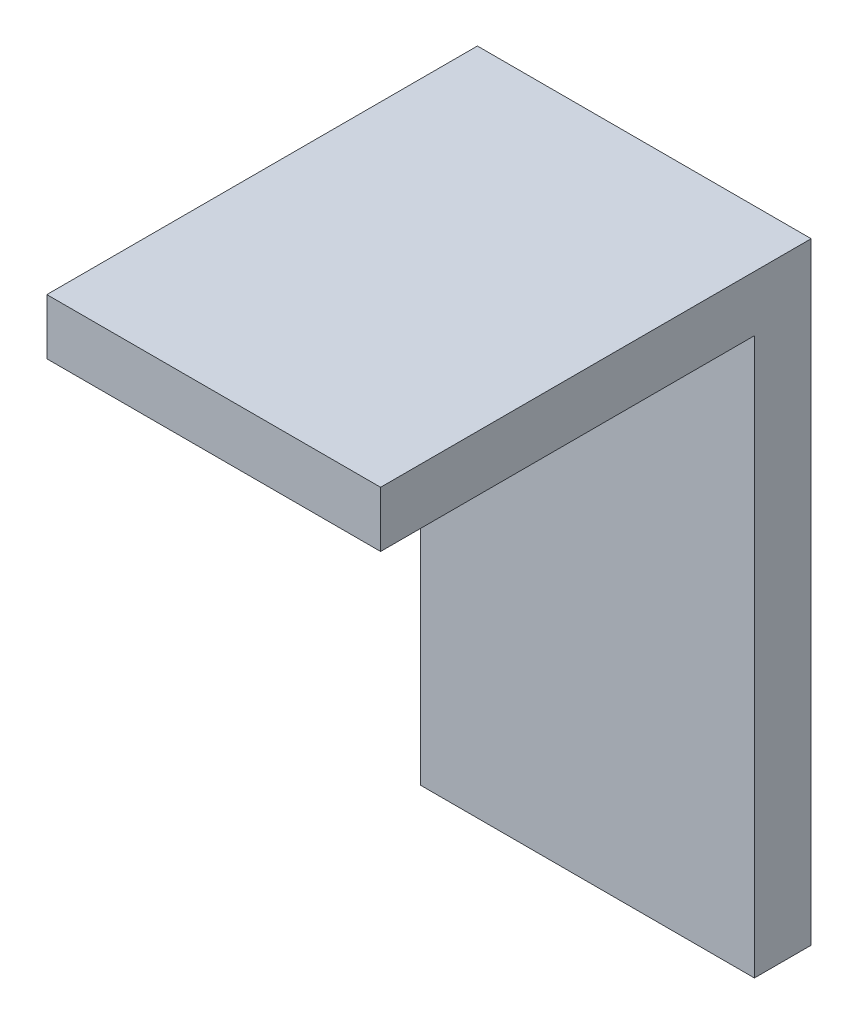
ISO-10303-21;
HEADER;
FILE_DESCRIPTION(('STEP AP214'),'2;1');
FILE_NAME('part.step','',(''),(''),'','','');
FILE_SCHEMA(('AUTOMOTIVE_DESIGN { 1 0 10303 214 1 1 1 1 }'));
ENDSEC;
DATA;
#1=APPLICATION_CONTEXT('core data for automotive mechanical design processes');
#2=APPLICATION_PROTOCOL_DEFINITION('international standard','automotive_design',2000,#1);
#3=PRODUCT_CONTEXT('',#1,'mechanical');
#4=PRODUCT('Part','Part','',(#3));
#5=PRODUCT_RELATED_PRODUCT_CATEGORY('part','',(#4));
#6=PRODUCT_DEFINITION_FORMATION('','',#4);
#7=PRODUCT_DEFINITION_CONTEXT('part definition',#1,'design');
#8=PRODUCT_DEFINITION('design','',#6,#7);
#9=PRODUCT_DEFINITION_SHAPE('','',#8);
#10=(LENGTH_UNIT() NAMED_UNIT(*) SI_UNIT(.MILLI.,.METRE.));
#11=(NAMED_UNIT(*) PLANE_ANGLE_UNIT() SI_UNIT($,.RADIAN.));
#12=(NAMED_UNIT(*) SI_UNIT($,.STERADIAN.) SOLID_ANGLE_UNIT());
#13=UNCERTAINTY_MEASURE_WITH_UNIT(LENGTH_MEASURE(1.E-05),#10,'distance_accuracy_value','');
#14=(GEOMETRIC_REPRESENTATION_CONTEXT(3) GLOBAL_UNCERTAINTY_ASSIGNED_CONTEXT((#13)) GLOBAL_UNIT_ASSIGNED_CONTEXT((#10,
#11,#12)) REPRESENTATION_CONTEXT('',''));
#15=CARTESIAN_POINT('',(0.,0.,0.));
#16=DIRECTION('',(0.,0.,1.));
#17=DIRECTION('',(1.,0.,0.));
#18=AXIS2_PLACEMENT_3D('',#15,#16,#17);
#19=CARTESIAN_POINT('',(1.6,4.55,0.));
#20=DIRECTION('',(-1.,0.,0.));
#21=DIRECTION('',(0.,0.,1.));
#22=AXIS2_PLACEMENT_3D('',#19,#20,#21);
#23=PLANE('',#22);
#24=DIRECTION('',(0.,1.,0.));
#25=VECTOR('',#24,1.);
#26=CARTESIAN_POINT('',(1.6,4.,0.));
#27=LINE('',#26,#25);
#28=CARTESIAN_POINT('',(1.6,4.,0.));
#29=VERTEX_POINT('',#28);
#30=CARTESIAN_POINT('',(1.6,4.55,0.));
#31=VERTEX_POINT('',#30);
#32=EDGE_CURVE('E11',#29,#31,#27,.T.);
#33=ORIENTED_EDGE('',*,*,#32,.F.);
#34=DIRECTION('',(0.,0.,-1.));
#35=VECTOR('',#34,1.);
#36=CARTESIAN_POINT('',(1.6,4.,0.051));
#37=LINE('',#36,#35);
#38=CARTESIAN_POINT('',(1.6,4.,0.051));
#39=VERTEX_POINT('',#38);
#40=EDGE_CURVE('E24',#39,#29,#37,.T.);
#41=ORIENTED_EDGE('',*,*,#40,.F.);
#42=DIRECTION('',(0.,-1.,0.));
#43=VECTOR('',#42,1.);
#44=CARTESIAN_POINT('',(1.6,4.5,0.051));
#45=LINE('',#44,#43);
#46=CARTESIAN_POINT('',(1.6,4.5,0.051));
#47=VERTEX_POINT('',#46);
#48=EDGE_CURVE('E87',#47,#39,#45,.T.);
#49=ORIENTED_EDGE('',*,*,#48,.F.);
#50=DIRECTION('',(0.,0.,-1.));
#51=VECTOR('',#50,1.);
#52=CARTESIAN_POINT('',(1.6,4.5,0.387));
#53=LINE('',#52,#51);
#54=CARTESIAN_POINT('',(1.6,4.5,0.387));
#55=VERTEX_POINT('',#54);
#56=EDGE_CURVE('E114',#55,#47,#53,.T.);
#57=ORIENTED_EDGE('',*,*,#56,.F.);
#58=DIRECTION('',(0.,-1.,0.));
#59=VECTOR('',#58,1.);
#60=CARTESIAN_POINT('',(1.6,4.55,0.387));
#61=LINE('',#60,#59);
#62=CARTESIAN_POINT('',(1.6,4.55,0.387));
#63=VERTEX_POINT('',#62);
#64=EDGE_CURVE('E111',#63,#55,#61,.T.);
#65=ORIENTED_EDGE('',*,*,#64,.F.);
#66=DIRECTION('',(0.,0.,1.));
#67=VECTOR('',#66,1.);
#68=CARTESIAN_POINT('',(1.6,4.55,0.));
#69=LINE('',#68,#67);
#70=EDGE_CURVE('E108',#31,#63,#69,.T.);
#71=ORIENTED_EDGE('',*,*,#70,.F.);
#72=EDGE_LOOP('',(#33,#41,#49,#57,#65,#71));
#73=FACE_BOUND('',#72,.T.);
#74=ADVANCED_FACE('F17',(#73),#23,.T.);
#75=CARTESIAN_POINT('',(1.9,4.,0.));
#76=DIRECTION('',(1.,0.,0.));
#77=DIRECTION('',(0.,0.,1.));
#78=AXIS2_PLACEMENT_3D('',#75,#76,#77);
#79=PLANE('',#78);
#80=DIRECTION('',(0.,-1.,0.));
#81=VECTOR('',#80,1.);
#82=CARTESIAN_POINT('',(1.9,4.55,0.));
#83=LINE('',#82,#81);
#84=CARTESIAN_POINT('',(1.9,4.55,0.));
#85=VERTEX_POINT('',#84);
#86=CARTESIAN_POINT('',(1.9,4.,0.));
#87=VERTEX_POINT('',#86);
#88=EDGE_CURVE('E106',#85,#87,#83,.T.);
#89=ORIENTED_EDGE('',*,*,#88,.F.);
#90=DIRECTION('',(0.,0.,-1.));
#91=VECTOR('',#90,1.);
#92=CARTESIAN_POINT('',(1.9,4.55,0.387));
#93=LINE('',#92,#91);
#94=CARTESIAN_POINT('',(1.9,4.55,0.387));
#95=VERTEX_POINT('',#94);
#96=EDGE_CURVE('E103',#95,#85,#93,.T.);
#97=ORIENTED_EDGE('',*,*,#96,.F.);
#98=DIRECTION('',(0.,1.,0.));
#99=VECTOR('',#98,1.);
#100=CARTESIAN_POINT('',(1.9,4.5,0.387));
#101=LINE('',#100,#99);
#102=CARTESIAN_POINT('',(1.9,4.5,0.387));
#103=VERTEX_POINT('',#102);
#104=EDGE_CURVE('E100',#103,#95,#101,.T.);
#105=ORIENTED_EDGE('',*,*,#104,.F.);
#106=DIRECTION('',(0.,0.,1.));
#107=VECTOR('',#106,1.);
#108=CARTESIAN_POINT('',(1.9,4.5,0.051));
#109=LINE('',#108,#107);
#110=CARTESIAN_POINT('',(1.9,4.5,0.051));
#111=VERTEX_POINT('',#110);
#112=EDGE_CURVE('E72',#111,#103,#109,.T.);
#113=ORIENTED_EDGE('',*,*,#112,.F.);
#114=DIRECTION('',(0.,1.,0.));
#115=VECTOR('',#114,1.);
#116=CARTESIAN_POINT('',(1.9,4.,0.051));
#117=LINE('',#116,#115);
#118=CARTESIAN_POINT('',(1.9,4.,0.051));
#119=VERTEX_POINT('',#118);
#120=EDGE_CURVE('E66',#119,#111,#117,.T.);
#121=ORIENTED_EDGE('',*,*,#120,.F.);
#122=DIRECTION('',(0.,0.,1.));
#123=VECTOR('',#122,1.);
#124=CARTESIAN_POINT('',(1.9,4.,0.));
#125=LINE('',#124,#123);
#126=EDGE_CURVE('E69',#87,#119,#125,.T.);
#127=ORIENTED_EDGE('',*,*,#126,.F.);
#128=EDGE_LOOP('',(#89,#97,#105,#113,#121,#127));
#129=FACE_BOUND('',#128,.T.);
#130=ADVANCED_FACE('F68',(#129),#79,.T.);
#131=CARTESIAN_POINT('',(1.6,4.55,0.387));
#132=DIRECTION('',(0.,0.,1.));
#133=DIRECTION('',(0.,1.,0.));
#134=AXIS2_PLACEMENT_3D('',#131,#132,#133);
#135=PLANE('',#134);
#136=ORIENTED_EDGE('',*,*,#64,.T.);
#137=DIRECTION('',(-1.,0.,0.));
#138=VECTOR('',#137,1.);
#139=CARTESIAN_POINT('',(1.9,4.5,0.387));
#140=LINE('',#139,#138);
#141=EDGE_CURVE('E83',#103,#55,#140,.T.);
#142=ORIENTED_EDGE('',*,*,#141,.F.);
#143=ORIENTED_EDGE('',*,*,#104,.T.);
#144=DIRECTION('',(1.,0.,0.));
#145=VECTOR('',#144,1.);
#146=CARTESIAN_POINT('',(1.6,4.55,0.387));
#147=LINE('',#146,#145);
#148=EDGE_CURVE('E88',#63,#95,#147,.T.);
#149=ORIENTED_EDGE('',*,*,#148,.F.);
#150=EDGE_LOOP('',(#136,#142,#143,#149));
#151=FACE_BOUND('',#150,.T.);
#152=ADVANCED_FACE('F125',(#151),#135,.T.);
#153=CARTESIAN_POINT('',(1.6,4.5,0.051));
#154=DIRECTION('',(0.,0.,1.));
#155=DIRECTION('',(0.,1.,0.));
#156=AXIS2_PLACEMENT_3D('',#153,#154,#155);
#157=PLANE('',#156);
#158=ORIENTED_EDGE('',*,*,#48,.T.);
#159=DIRECTION('',(-1.,0.,0.));
#160=VECTOR('',#159,1.);
#161=CARTESIAN_POINT('',(1.9,4.,0.051));
#162=LINE('',#161,#160);
#163=EDGE_CURVE('E81',#119,#39,#162,.T.);
#164=ORIENTED_EDGE('',*,*,#163,.F.);
#165=ORIENTED_EDGE('',*,*,#120,.T.);
#166=DIRECTION('',(1.,0.,0.));
#167=VECTOR('',#166,1.);
#168=CARTESIAN_POINT('',(1.6,4.5,0.051));
#169=LINE('',#168,#167);
#170=EDGE_CURVE('E89',#47,#111,#169,.T.);
#171=ORIENTED_EDGE('',*,*,#170,.F.);
#172=EDGE_LOOP('',(#158,#164,#165,#171));
#173=FACE_BOUND('',#172,.T.);
#174=ADVANCED_FACE('F86',(#173),#157,.T.);
#175=CARTESIAN_POINT('',(1.9,4.55,0.));
#176=DIRECTION('',(0.,1.,0.));
#177=DIRECTION('',(0.,0.,1.));
#178=AXIS2_PLACEMENT_3D('',#175,#176,#177);
#179=PLANE('',#178);
#180=DIRECTION('',(1.,0.,0.));
#181=VECTOR('',#180,1.);
#182=CARTESIAN_POINT('',(1.6,4.55,0.));
#183=LINE('',#182,#181);
#184=EDGE_CURVE('E93',#31,#85,#183,.T.);
#185=ORIENTED_EDGE('',*,*,#184,.F.);
#186=ORIENTED_EDGE('',*,*,#70,.T.);
#187=ORIENTED_EDGE('',*,*,#148,.T.);
#188=ORIENTED_EDGE('',*,*,#96,.T.);
#189=EDGE_LOOP('',(#185,#186,#187,#188));
#190=FACE_BOUND('',#189,.T.);
#191=ADVANCED_FACE('F121',(#190),#179,.T.);
#192=CARTESIAN_POINT('',(1.6,4.,0.));
#193=DIRECTION('',(0.,-1.,0.));
#194=DIRECTION('',(0.,0.,1.));
#195=AXIS2_PLACEMENT_3D('',#192,#193,#194);
#196=PLANE('',#195);
#197=DIRECTION('',(-1.,0.,0.));
#198=VECTOR('',#197,1.);
#199=CARTESIAN_POINT('',(1.9,4.,0.));
#200=LINE('',#199,#198);
#201=EDGE_CURVE('E82',#87,#29,#200,.T.);
#202=ORIENTED_EDGE('',*,*,#201,.F.);
#203=ORIENTED_EDGE('',*,*,#126,.T.);
#204=ORIENTED_EDGE('',*,*,#163,.T.);
#205=ORIENTED_EDGE('',*,*,#40,.T.);
#206=EDGE_LOOP('',(#202,#203,#204,#205));
#207=FACE_BOUND('',#206,.T.);
#208=ADVANCED_FACE('F80',(#207),#196,.T.);
#209=CARTESIAN_POINT('',(1.6,4.5,0.051));
#210=DIRECTION('',(0.,-1.,0.));
#211=DIRECTION('',(0.,0.,1.));
#212=AXIS2_PLACEMENT_3D('',#209,#210,#211);
#213=PLANE('',#212);
#214=ORIENTED_EDGE('',*,*,#170,.T.);
#215=ORIENTED_EDGE('',*,*,#112,.T.);
#216=ORIENTED_EDGE('',*,*,#141,.T.);
#217=ORIENTED_EDGE('',*,*,#56,.T.);
#218=EDGE_LOOP('',(#214,#215,#216,#217));
#219=FACE_BOUND('',#218,.T.);
#220=ADVANCED_FACE('F127',(#219),#213,.T.);
#221=CARTESIAN_POINT('',(1.9,4.55,0.));
#222=DIRECTION('',(0.,0.,-1.));
#223=DIRECTION('',(0.,1.,0.));
#224=AXIS2_PLACEMENT_3D('',#221,#222,#223);
#225=PLANE('',#224);
#226=ORIENTED_EDGE('',*,*,#88,.T.);
#227=ORIENTED_EDGE('',*,*,#201,.T.);
#228=ORIENTED_EDGE('',*,*,#32,.T.);
#229=ORIENTED_EDGE('',*,*,#184,.T.);
#230=EDGE_LOOP('',(#226,#227,#228,#229));
#231=FACE_BOUND('',#230,.T.);
#232=ADVANCED_FACE('F117',(#231),#225,.T.);
#233=CLOSED_SHELL('',(#74,#130,#152,#174,#191,#208,#220,#232));
#234=MANIFOLD_SOLID_BREP('B1',#233);
#235=ADVANCED_BREP_SHAPE_REPRESENTATION('',(#18,#234),#14);
#236=SHAPE_DEFINITION_REPRESENTATION(#9,#235);
ENDSEC;
END-ISO-10303-21;
